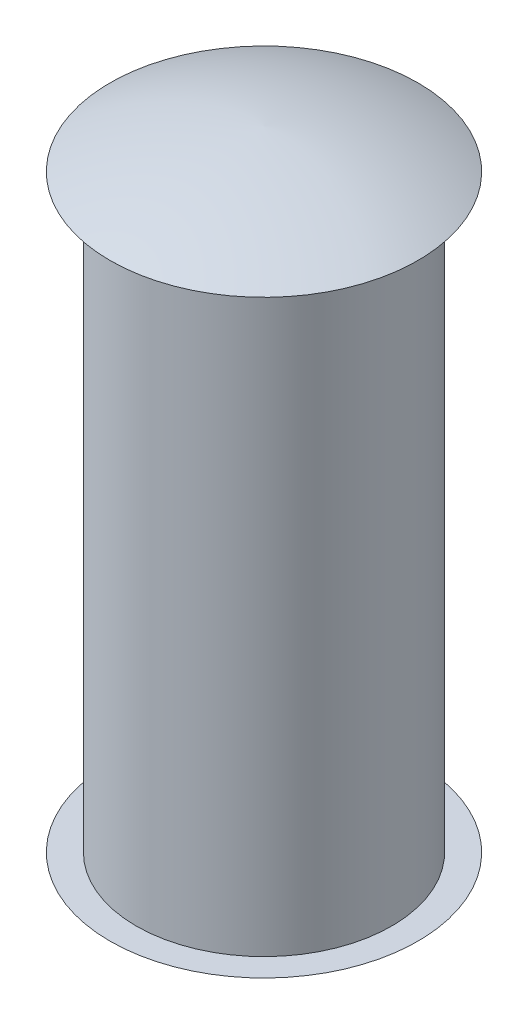
ISO-10303-21;
HEADER;
FILE_DESCRIPTION(('STEP AP214'),'2;1');
FILE_NAME('part.step','',(''),(''),'','','');
FILE_SCHEMA(('AUTOMOTIVE_DESIGN { 1 0 10303 214 1 1 1 1 }'));
ENDSEC;
DATA;
#1=APPLICATION_CONTEXT('core data for automotive mechanical design processes');
#2=APPLICATION_PROTOCOL_DEFINITION('international standard','automotive_design',2000,#1);
#3=PRODUCT_CONTEXT('',#1,'mechanical');
#4=PRODUCT('Part','Part','',(#3));
#5=PRODUCT_RELATED_PRODUCT_CATEGORY('part','',(#4));
#6=PRODUCT_DEFINITION_FORMATION('','',#4);
#7=PRODUCT_DEFINITION_CONTEXT('part definition',#1,'design');
#8=PRODUCT_DEFINITION('design','',#6,#7);
#9=PRODUCT_DEFINITION_SHAPE('','',#8);
#10=(LENGTH_UNIT() NAMED_UNIT(*) SI_UNIT(.MILLI.,.METRE.));
#11=(NAMED_UNIT(*) PLANE_ANGLE_UNIT() SI_UNIT($,.RADIAN.));
#12=(NAMED_UNIT(*) SI_UNIT($,.STERADIAN.) SOLID_ANGLE_UNIT());
#13=UNCERTAINTY_MEASURE_WITH_UNIT(LENGTH_MEASURE(1.E-05),#10,'distance_accuracy_value','');
#14=(GEOMETRIC_REPRESENTATION_CONTEXT(3) GLOBAL_UNCERTAINTY_ASSIGNED_CONTEXT((#13)) GLOBAL_UNIT_ASSIGNED_CONTEXT((#10,
#11,#12)) REPRESENTATION_CONTEXT('',''));
#15=CARTESIAN_POINT('',(0.,0.,0.));
#16=DIRECTION('',(0.,0.,1.));
#17=DIRECTION('',(1.,0.,0.));
#18=AXIS2_PLACEMENT_3D('',#15,#16,#17);
#19=CARTESIAN_POINT('',(0.,22.5,0.));
#20=DIRECTION('',(0.,-1.,0.));
#21=DIRECTION('',(0.,0.,-1.));
#22=AXIS2_PLACEMENT_3D('',#19,#20,#21);
#23=CYLINDRICAL_SURFACE('',#22,9.75);
#24=CARTESIAN_POINT('',(0.,22.5,0.));
#25=DIRECTION('',(0.,1.,0.));
#26=DIRECTION('',(0.,0.,1.));
#27=AXIS2_PLACEMENT_3D('',#24,#25,#26);
#28=CIRCLE('',#27,9.75);
#29=CARTESIAN_POINT('',(0.,22.5,9.75));
#30=VERTEX_POINT('',#29);
#31=EDGE_CURVE('E11',#30,#30,#28,.T.);
#32=ORIENTED_EDGE('',*,*,#31,.F.);
#33=EDGE_LOOP('',(#32));
#34=FACE_BOUND('',#33,.T.);
#35=CARTESIAN_POINT('',(0.,-22.5,0.));
#36=DIRECTION('',(0.,1.,0.));
#37=DIRECTION('',(0.,0.,1.));
#38=AXIS2_PLACEMENT_3D('',#35,#36,#37);
#39=CIRCLE('',#38,9.75);
#40=CARTESIAN_POINT('',(0.,-22.5,9.75));
#41=VERTEX_POINT('',#40);
#42=EDGE_CURVE('E55',#41,#41,#39,.T.);
#43=ORIENTED_EDGE('',*,*,#42,.T.);
#44=EDGE_LOOP('',(#43));
#45=FACE_BOUND('',#44,.T.);
#46=ADVANCED_FACE('F32',(#34,#45),#23,.T.);
#47=CARTESIAN_POINT('',(0.,-4.46762638446654,1.39333014071486));
#48=DIRECTION('',(-1.,0.,0.));
#49=DIRECTION('',(0.,0.,-1.));
#50=AXIS2_PLACEMENT_3D('',#47,#48,#49);
#51=CIRCLE('',#50,30.);
#52=TRIMMED_CURVE('',#51,(PARAMETER_VALUE(-1.52433527521043)),
(PARAMETER_VALUE(1.52433527521043)),.T.,.PARAMETER.);
#53=CARTESIAN_POINT('',(0.,-4.46762638446654,0.));
#54=DIRECTION('',(0.,-1.,0.));
#55=AXIS1_PLACEMENT('',#53,#54);
#56=SURFACE_OF_REVOLUTION('',#52,#55);
#57=CARTESIAN_POINT('',(0.,25.5,0.));
#58=VERTEX_POINT('',#57);
#59=VERTEX_LOOP('',#58);
#60=FACE_BOUND('',#59,.T.);
#61=CARTESIAN_POINT('',(0.,22.5,0.));
#62=DIRECTION('',(0.,-1.,0.));
#63=DIRECTION('',(0.,0.,-1.));
#64=AXIS2_PLACEMENT_3D('',#61,#62,#63);
#65=CIRCLE('',#64,11.75);
#66=CARTESIAN_POINT('',(0.,22.5,-11.75));
#67=VERTEX_POINT('',#66);
#68=EDGE_CURVE('E39',#67,#67,#65,.T.);
#69=ORIENTED_EDGE('',*,*,#68,.F.);
#70=EDGE_LOOP('',(#69));
#71=FACE_BOUND('',#70,.T.);
#72=ADVANCED_FACE('F63',(#60,#71),#56,.T.);
#73=CARTESIAN_POINT('',(0.,22.5,0.));
#74=DIRECTION('',(0.,-1.,0.));
#75=DIRECTION('',(0.,0.,-1.));
#76=AXIS2_PLACEMENT_3D('',#73,#74,#75);
#77=PLANE('',#76);
#78=ORIENTED_EDGE('',*,*,#31,.T.);
#79=EDGE_LOOP('',(#78));
#80=FACE_BOUND('',#79,.T.);
#81=ORIENTED_EDGE('',*,*,#68,.T.);
#82=EDGE_LOOP('',(#81));
#83=FACE_BOUND('',#82,.T.);
#84=ADVANCED_FACE('F49',(#80,#83),#77,.T.);
#85=CARTESIAN_POINT('',(0.,4.46762638446654,1.39333014071486));
#86=DIRECTION('',(1.,0.,0.));
#87=DIRECTION('',(0.,0.,-1.));
#88=AXIS2_PLACEMENT_3D('',#85,#86,#87);
#89=CIRCLE('',#88,30.);
#90=TRIMMED_CURVE('',#89,(PARAMETER_VALUE(-1.52433527521043)),
(PARAMETER_VALUE(1.52433527521043)),.T.,.PARAMETER.);
#91=CARTESIAN_POINT('',(0.,4.46762638446654,0.));
#92=DIRECTION('',(0.,1.,0.));
#93=AXIS1_PLACEMENT('',#91,#92);
#94=SURFACE_OF_REVOLUTION('',#90,#93);
#95=CARTESIAN_POINT('',(0.,-25.5,0.));
#96=VERTEX_POINT('',#95);
#97=VERTEX_LOOP('',#96);
#98=FACE_BOUND('',#97,.T.);
#99=CARTESIAN_POINT('',(0.,-22.5,0.));
#100=DIRECTION('',(0.,-1.,0.));
#101=DIRECTION('',(0.,0.,-1.));
#102=AXIS2_PLACEMENT_3D('',#99,#100,#101);
#103=CIRCLE('',#102,11.75);
#104=CARTESIAN_POINT('',(0.,-22.5,-11.75));
#105=VERTEX_POINT('',#104);
#106=EDGE_CURVE('E53',#105,#105,#103,.T.);
#107=ORIENTED_EDGE('',*,*,#106,.T.);
#108=EDGE_LOOP('',(#107));
#109=FACE_BOUND('',#108,.T.);
#110=ADVANCED_FACE('F45',(#98,#109),#94,.T.);
#111=CARTESIAN_POINT('',(0.,-22.5,0.));
#112=DIRECTION('',(0.,1.,0.));
#113=DIRECTION('',(0.,0.,-1.));
#114=AXIS2_PLACEMENT_3D('',#111,#112,#113);
#115=PLANE('',#114);
#116=ORIENTED_EDGE('',*,*,#42,.F.);
#117=EDGE_LOOP('',(#116));
#118=FACE_BOUND('',#117,.T.);
#119=ORIENTED_EDGE('',*,*,#106,.F.);
#120=EDGE_LOOP('',(#119));
#121=FACE_BOUND('',#120,.T.);
#122=ADVANCED_FACE('F48',(#118,#121),#115,.T.);
#123=CLOSED_SHELL('',(#46,#72,#84,#110,#122));
#124=MANIFOLD_SOLID_BREP('B2',#123);
#125=ADVANCED_BREP_SHAPE_REPRESENTATION('',(#18,#124),#14);
#126=SHAPE_DEFINITION_REPRESENTATION(#9,#125);
ENDSEC;
END-ISO-10303-21;
